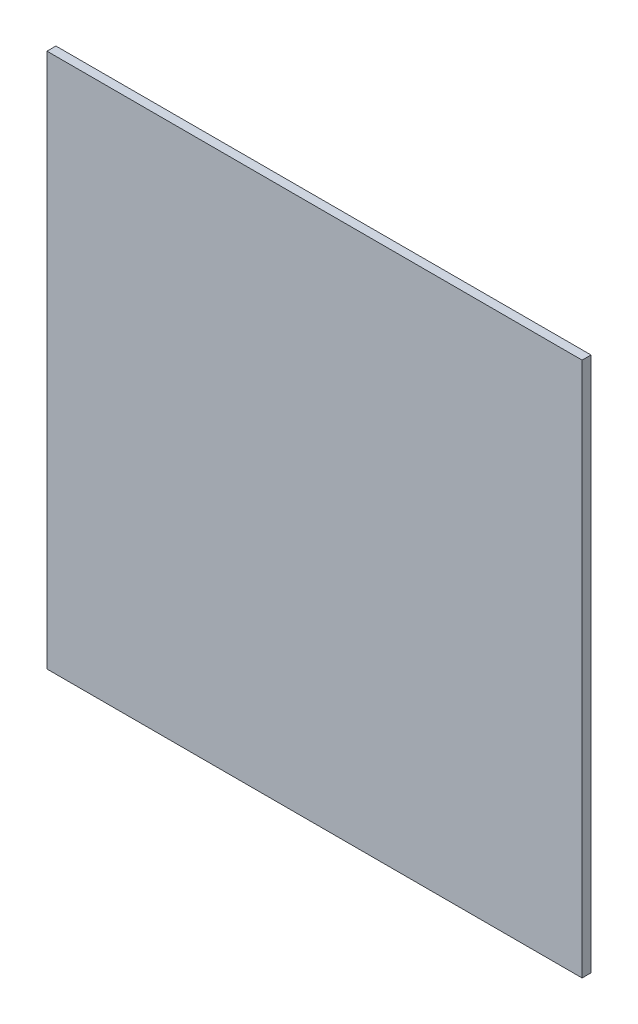
ISO-10303-21;
HEADER;
FILE_DESCRIPTION(('STEP AP214'),'2;1');
FILE_NAME('part.step','',(''),(''),'','','');
FILE_SCHEMA(('AUTOMOTIVE_DESIGN { 1 0 10303 214 1 1 1 1 }'));
ENDSEC;
DATA;
#1=APPLICATION_CONTEXT('core data for automotive mechanical design processes');
#2=APPLICATION_PROTOCOL_DEFINITION('international standard','automotive_design',2000,#1);
#3=PRODUCT_CONTEXT('',#1,'mechanical');
#4=PRODUCT('Part','Part','',(#3));
#5=PRODUCT_RELATED_PRODUCT_CATEGORY('part','',(#4));
#6=PRODUCT_DEFINITION_FORMATION('','',#4);
#7=PRODUCT_DEFINITION_CONTEXT('part definition',#1,'design');
#8=PRODUCT_DEFINITION('design','',#6,#7);
#9=PRODUCT_DEFINITION_SHAPE('','',#8);
#10=(LENGTH_UNIT() NAMED_UNIT(*) SI_UNIT(.MILLI.,.METRE.));
#11=(NAMED_UNIT(*) PLANE_ANGLE_UNIT() SI_UNIT($,.RADIAN.));
#12=(NAMED_UNIT(*) SI_UNIT($,.STERADIAN.) SOLID_ANGLE_UNIT());
#13=UNCERTAINTY_MEASURE_WITH_UNIT(LENGTH_MEASURE(1.E-05),#10,'distance_accuracy_value','');
#14=(GEOMETRIC_REPRESENTATION_CONTEXT(3) GLOBAL_UNCERTAINTY_ASSIGNED_CONTEXT((#13)) GLOBAL_UNIT_ASSIGNED_CONTEXT((#10,
#11,#12)) REPRESENTATION_CONTEXT('',''));
#15=CARTESIAN_POINT('',(0.,0.,0.));
#16=DIRECTION('',(0.,0.,1.));
#17=DIRECTION('',(1.,0.,0.));
#18=AXIS2_PLACEMENT_3D('',#15,#16,#17);
#19=CARTESIAN_POINT('',(0.,0.,3.));
#20=DIRECTION('',(1.,0.,0.));
#21=DIRECTION('',(0.,0.,-1.));
#22=AXIS2_PLACEMENT_3D('',#19,#20,#21);
#23=PLANE('',#22);
#24=DIRECTION('',(0.,-1.,0.));
#25=VECTOR('',#24,1.);
#26=CARTESIAN_POINT('',(0.,0.,0.));
#27=LINE('',#26,#25);
#28=CARTESIAN_POINT('',(0.,180.,0.));
#29=VERTEX_POINT('',#28);
#30=CARTESIAN_POINT('',(0.,0.,0.));
#31=VERTEX_POINT('',#30);
#32=EDGE_CURVE('E107',#29,#31,#27,.T.);
#33=ORIENTED_EDGE('',*,*,#32,.T.);
#34=DIRECTION('',(0.,0.,-1.));
#35=VECTOR('',#34,1.);
#36=CARTESIAN_POINT('',(0.,0.,3.));
#37=LINE('',#36,#35);
#38=CARTESIAN_POINT('',(0.,0.,3.));
#39=VERTEX_POINT('',#38);
#40=EDGE_CURVE('E11',#39,#31,#37,.T.);
#41=ORIENTED_EDGE('',*,*,#40,.F.);
#42=DIRECTION('',(0.,-1.,0.));
#43=VECTOR('',#42,1.);
#44=CARTESIAN_POINT('',(0.,0.,3.));
#45=LINE('',#44,#43);
#46=CARTESIAN_POINT('',(0.,180.,3.));
#47=VERTEX_POINT('',#46);
#48=EDGE_CURVE('E91',#47,#39,#45,.T.);
#49=ORIENTED_EDGE('',*,*,#48,.F.);
#50=DIRECTION('',(0.,0.,-1.));
#51=VECTOR('',#50,1.);
#52=CARTESIAN_POINT('',(0.,180.,3.));
#53=LINE('',#52,#51);
#54=EDGE_CURVE('E103',#47,#29,#53,.T.);
#55=ORIENTED_EDGE('',*,*,#54,.T.);
#56=EDGE_LOOP('',(#33,#41,#49,#55));
#57=FACE_BOUND('',#56,.T.);
#58=ADVANCED_FACE('F39',(#57),#23,.F.);
#59=CARTESIAN_POINT('',(0.,0.,3.));
#60=DIRECTION('',(0.,1.,0.));
#61=DIRECTION('',(0.,0.,1.));
#62=AXIS2_PLACEMENT_3D('',#59,#60,#61);
#63=PLANE('',#62);
#64=DIRECTION('',(1.,0.,0.));
#65=VECTOR('',#64,1.);
#66=CARTESIAN_POINT('',(0.,0.,0.));
#67=LINE('',#66,#65);
#68=CARTESIAN_POINT('',(180.,0.,0.));
#69=VERTEX_POINT('',#68);
#70=EDGE_CURVE('E96',#31,#69,#67,.T.);
#71=ORIENTED_EDGE('',*,*,#70,.T.);
#72=DIRECTION('',(0.,0.,-1.));
#73=VECTOR('',#72,1.);
#74=CARTESIAN_POINT('',(180.,0.,3.));
#75=LINE('',#74,#73);
#76=CARTESIAN_POINT('',(180.,0.,3.));
#77=VERTEX_POINT('',#76);
#78=EDGE_CURVE('E48',#77,#69,#75,.T.);
#79=ORIENTED_EDGE('',*,*,#78,.F.);
#80=DIRECTION('',(1.,0.,0.));
#81=VECTOR('',#80,1.);
#82=CARTESIAN_POINT('',(0.,0.,3.));
#83=LINE('',#82,#81);
#84=EDGE_CURVE('E86',#39,#77,#83,.T.);
#85=ORIENTED_EDGE('',*,*,#84,.F.);
#86=ORIENTED_EDGE('',*,*,#40,.T.);
#87=EDGE_LOOP('',(#71,#79,#85,#86));
#88=FACE_BOUND('',#87,.T.);
#89=ADVANCED_FACE('F95',(#88),#63,.F.);
#90=CARTESIAN_POINT('',(180.,0.,3.));
#91=DIRECTION('',(-1.,0.,0.));
#92=DIRECTION('',(0.,0.,1.));
#93=AXIS2_PLACEMENT_3D('',#90,#91,#92);
#94=PLANE('',#93);
#95=DIRECTION('',(0.,1.,0.));
#96=VECTOR('',#95,1.);
#97=CARTESIAN_POINT('',(180.,0.,0.));
#98=LINE('',#97,#96);
#99=CARTESIAN_POINT('',(180.,180.,0.));
#100=VERTEX_POINT('',#99);
#101=EDGE_CURVE('E73',#69,#100,#98,.T.);
#102=ORIENTED_EDGE('',*,*,#101,.T.);
#103=DIRECTION('',(0.,0.,-1.));
#104=VECTOR('',#103,1.);
#105=CARTESIAN_POINT('',(180.,180.,3.));
#106=LINE('',#105,#104);
#107=CARTESIAN_POINT('',(180.,180.,3.));
#108=VERTEX_POINT('',#107);
#109=EDGE_CURVE('E98',#108,#100,#106,.T.);
#110=ORIENTED_EDGE('',*,*,#109,.F.);
#111=DIRECTION('',(0.,1.,0.));
#112=VECTOR('',#111,1.);
#113=CARTESIAN_POINT('',(180.,0.,3.));
#114=LINE('',#113,#112);
#115=EDGE_CURVE('E89',#77,#108,#114,.T.);
#116=ORIENTED_EDGE('',*,*,#115,.F.);
#117=ORIENTED_EDGE('',*,*,#78,.T.);
#118=EDGE_LOOP('',(#102,#110,#116,#117));
#119=FACE_BOUND('',#118,.T.);
#120=ADVANCED_FACE('F99',(#119),#94,.F.);
#121=CARTESIAN_POINT('',(0.,180.,3.));
#122=DIRECTION('',(0.,-1.,0.));
#123=DIRECTION('',(1.,0.,0.));
#124=AXIS2_PLACEMENT_3D('',#121,#122,#123);
#125=PLANE('',#124);
#126=DIRECTION('',(-1.,0.,0.));
#127=VECTOR('',#126,1.);
#128=CARTESIAN_POINT('',(0.,180.,0.));
#129=LINE('',#128,#127);
#130=EDGE_CURVE('E79',#100,#29,#129,.T.);
#131=ORIENTED_EDGE('',*,*,#130,.T.);
#132=ORIENTED_EDGE('',*,*,#54,.F.);
#133=DIRECTION('',(-1.,0.,0.));
#134=VECTOR('',#133,1.);
#135=CARTESIAN_POINT('',(0.,180.,3.));
#136=LINE('',#135,#134);
#137=EDGE_CURVE('E56',#108,#47,#136,.T.);
#138=ORIENTED_EDGE('',*,*,#137,.F.);
#139=ORIENTED_EDGE('',*,*,#109,.T.);
#140=EDGE_LOOP('',(#131,#132,#138,#139));
#141=FACE_BOUND('',#140,.T.);
#142=ADVANCED_FACE('F120',(#141),#125,.F.);
#143=CARTESIAN_POINT('',(0.,0.,3.));
#144=DIRECTION('',(0.,0.,-1.));
#145=DIRECTION('',(-1.,0.,0.));
#146=AXIS2_PLACEMENT_3D('',#143,#144,#145);
#147=PLANE('',#146);
#148=ORIENTED_EDGE('',*,*,#48,.T.);
#149=ORIENTED_EDGE('',*,*,#84,.T.);
#150=ORIENTED_EDGE('',*,*,#115,.T.);
#151=ORIENTED_EDGE('',*,*,#137,.T.);
#152=EDGE_LOOP('',(#148,#149,#150,#151));
#153=FACE_BOUND('',#152,.T.);
#154=ADVANCED_FACE('F87',(#153),#147,.F.);
#155=CARTESIAN_POINT('',(0.,0.,0.));
#156=DIRECTION('',(0.,0.,-1.));
#157=DIRECTION('',(-1.,0.,0.));
#158=AXIS2_PLACEMENT_3D('',#155,#156,#157);
#159=PLANE('',#158);
#160=ORIENTED_EDGE('',*,*,#32,.F.);
#161=ORIENTED_EDGE('',*,*,#130,.F.);
#162=ORIENTED_EDGE('',*,*,#101,.F.);
#163=ORIENTED_EDGE('',*,*,#70,.F.);
#164=EDGE_LOOP('',(#160,#161,#162,#163));
#165=FACE_BOUND('',#164,.T.);
#166=ADVANCED_FACE('F123',(#165),#159,.T.);
#167=CLOSED_SHELL('',(#58,#89,#120,#142,#154,#166));
#168=MANIFOLD_SOLID_BREP('B2',#167);
#169=ADVANCED_BREP_SHAPE_REPRESENTATION('',(#18,#168),#14);
#170=SHAPE_DEFINITION_REPRESENTATION(#9,#169);
ENDSEC;
END-ISO-10303-21;
